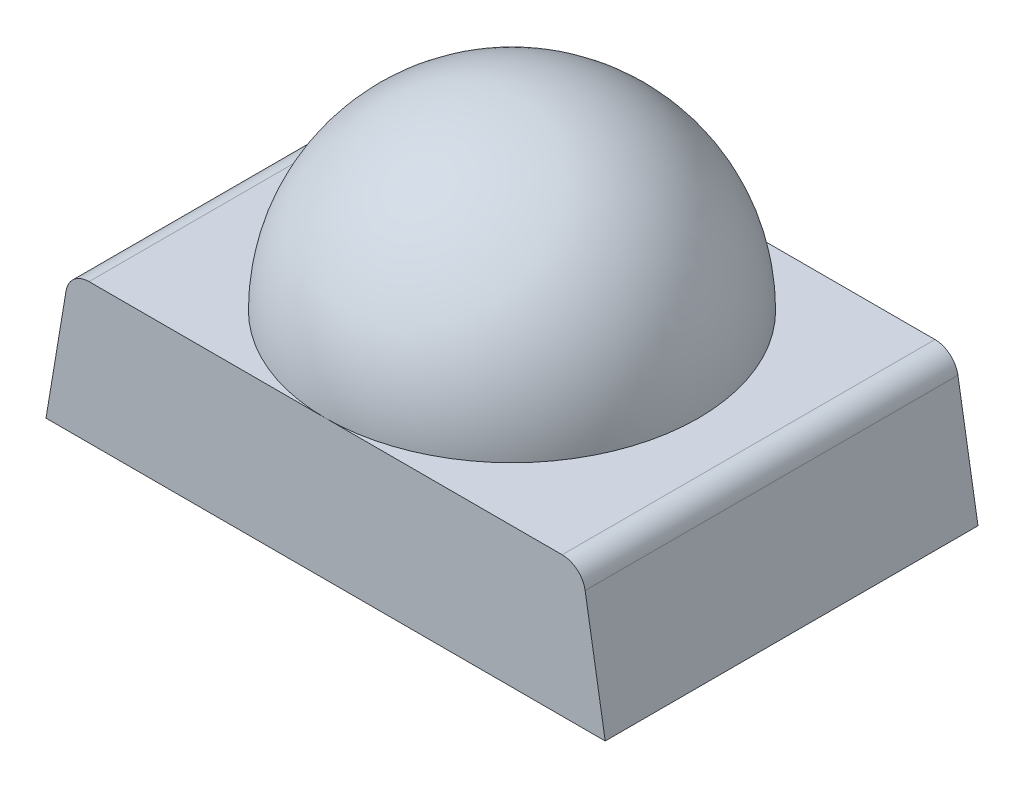
ISO-10303-21;
HEADER;
FILE_DESCRIPTION(('STEP AP214'),'2;1');
FILE_NAME('part.step','',(''),(''),'','','');
FILE_SCHEMA(('AUTOMOTIVE_DESIGN { 1 0 10303 214 1 1 1 1 }'));
ENDSEC;
DATA;
#1=APPLICATION_CONTEXT('core data for automotive mechanical design processes');
#2=APPLICATION_PROTOCOL_DEFINITION('international standard','automotive_design',2000,#1);
#3=PRODUCT_CONTEXT('',#1,'mechanical');
#4=PRODUCT('Part','Part','',(#3));
#5=PRODUCT_RELATED_PRODUCT_CATEGORY('part','',(#4));
#6=PRODUCT_DEFINITION_FORMATION('','',#4);
#7=PRODUCT_DEFINITION_CONTEXT('part definition',#1,'design');
#8=PRODUCT_DEFINITION('design','',#6,#7);
#9=PRODUCT_DEFINITION_SHAPE('','',#8);
#10=(LENGTH_UNIT() NAMED_UNIT(*) SI_UNIT(.MILLI.,.METRE.));
#11=(NAMED_UNIT(*) PLANE_ANGLE_UNIT() SI_UNIT($,.RADIAN.));
#12=(NAMED_UNIT(*) SI_UNIT($,.STERADIAN.) SOLID_ANGLE_UNIT());
#13=UNCERTAINTY_MEASURE_WITH_UNIT(LENGTH_MEASURE(1.E-05),#10,'distance_accuracy_value','');
#14=(GEOMETRIC_REPRESENTATION_CONTEXT(3) GLOBAL_UNCERTAINTY_ASSIGNED_CONTEXT((#13)) GLOBAL_UNIT_ASSIGNED_CONTEXT((#10,
#11,#12)) REPRESENTATION_CONTEXT('',''));
#15=CARTESIAN_POINT('',(0.,0.,0.));
#16=DIRECTION('',(0.,0.,1.));
#17=DIRECTION('',(1.,0.,0.));
#18=AXIS2_PLACEMENT_3D('',#15,#16,#17);
#19=CARTESIAN_POINT('',(0.,0.3,0.));
#20=DIRECTION('',(0.,-1.,0.));
#21=DIRECTION('',(0.,0.,-1.));
#22=AXIS2_PLACEMENT_3D('',#19,#20,#21);
#23=PLANE('',#22);
#24=DIRECTION('',(1.,0.,0.));
#25=VECTOR('',#24,1.);
#26=CARTESIAN_POINT('',(-0.6,0.3,0.4));
#27=LINE('',#26,#25);
#28=CARTESIAN_POINT('',(0.,0.3,0.4));
#29=VERTEX_POINT('',#28);
#30=CARTESIAN_POINT('',(0.507643645580848,0.3,0.4));
#31=VERTEX_POINT('',#30);
#32=EDGE_CURVE('E148',#29,#31,#27,.T.);
#33=ORIENTED_EDGE('',*,*,#32,.T.);
#34=DIRECTION('',(0.,0.,1.));
#35=VECTOR('',#34,1.);
#36=CARTESIAN_POINT('',(0.507643645580848,0.3,-0.4));
#37=LINE('',#36,#35);
#38=CARTESIAN_POINT('',(0.507643645580848,0.3,-0.4));
#39=VERTEX_POINT('',#38);
#40=EDGE_CURVE('E132',#31,#39,#37,.F.);
#41=ORIENTED_EDGE('',*,*,#40,.T.);
#42=DIRECTION('',(-1.,0.,0.));
#43=VECTOR('',#42,1.);
#44=CARTESIAN_POINT('',(-0.6,0.3,-0.4));
#45=LINE('',#44,#43);
#46=CARTESIAN_POINT('',(0.,0.3,-0.4));
#47=VERTEX_POINT('',#46);
#48=EDGE_CURVE('E149',#39,#47,#45,.T.);
#49=ORIENTED_EDGE('',*,*,#48,.T.);
#50=CARTESIAN_POINT('',(0.,0.3,0.));
#51=DIRECTION('',(0.,-1.,0.));
#52=DIRECTION('',(0.,0.,-1.));
#53=AXIS2_PLACEMENT_3D('',#50,#51,#52);
#54=CIRCLE('',#53,0.4);
#55=EDGE_CURVE('E106',#47,#29,#54,.T.);
#56=ORIENTED_EDGE('',*,*,#55,.T.);
#57=EDGE_LOOP('',(#33,#41,#49,#56));
#58=FACE_BOUND('',#57,.T.);
#59=ADVANCED_FACE('F34',(#58),#23,.F.);
#60=CARTESIAN_POINT('',(-0.6,0.3,-0.4));
#61=DIRECTION('',(0.,0.,1.));
#62=DIRECTION('',(1.,0.,0.));
#63=AXIS2_PLACEMENT_3D('',#60,#61,#62);
#64=PLANE('',#63);
#65=ORIENTED_EDGE('',*,*,#48,.F.);
#66=CARTESIAN_POINT('',(0.507643645580848,0.25,-0.4));
#67=DIRECTION('',(0.,0.,1.));
#68=DIRECTION('',(1.,0.,0.));
#69=AXIS2_PLACEMENT_3D('',#66,#67,#68);
#70=CIRCLE('',#69,0.05);
#71=CARTESIAN_POINT('',(0.556963341772455,0.258219949365268,-0.4));
#72=VERTEX_POINT('',#71);
#73=EDGE_CURVE('E113',#39,#72,#70,.F.);
#74=ORIENTED_EDGE('',*,*,#73,.T.);
#75=DIRECTION('',(-0.164398987305357,0.986393923832144,0.));
#76=VECTOR('',#75,1.);
#77=CARTESIAN_POINT('',(0.6,0.,-0.4));
#78=LINE('',#77,#76);
#79=CARTESIAN_POINT('',(0.6,0.,-0.4));
#80=VERTEX_POINT('',#79);
#81=EDGE_CURVE('E97',#80,#72,#78,.T.);
#82=ORIENTED_EDGE('',*,*,#81,.F.);
#83=DIRECTION('',(-1.,0.,0.));
#84=VECTOR('',#83,1.);
#85=CARTESIAN_POINT('',(-0.6,0.,-0.4));
#86=LINE('',#85,#84);
#87=CARTESIAN_POINT('',(-0.6,0.,-0.4));
#88=VERTEX_POINT('',#87);
#89=EDGE_CURVE('E105',#80,#88,#86,.T.);
#90=ORIENTED_EDGE('',*,*,#89,.T.);
#91=DIRECTION('',(0.164398987305357,0.986393923832144,0.));
#92=VECTOR('',#91,1.);
#93=CARTESIAN_POINT('',(-0.6,0.,-0.4));
#94=LINE('',#93,#92);
#95=CARTESIAN_POINT('',(-0.556963341772455,0.258219949365268,-0.4));
#96=VERTEX_POINT('',#95);
#97=EDGE_CURVE('E156',#88,#96,#94,.T.);
#98=ORIENTED_EDGE('',*,*,#97,.T.);
#99=CARTESIAN_POINT('',(-0.507643645580848,0.25,-0.4));
#100=DIRECTION('',(0.,0.,1.));
#101=DIRECTION('',(1.,0.,0.));
#102=AXIS2_PLACEMENT_3D('',#99,#100,#101);
#103=CIRCLE('',#102,0.05);
#104=CARTESIAN_POINT('',(-0.507643645580848,0.3,-0.4));
#105=VERTEX_POINT('',#104);
#106=EDGE_CURVE('E49',#96,#105,#103,.F.);
#107=ORIENTED_EDGE('',*,*,#106,.T.);
#108=EDGE_CURVE('E124',#47,#105,#45,.T.);
#109=ORIENTED_EDGE('',*,*,#108,.F.);
#110=EDGE_LOOP('',(#65,#74,#82,#90,#98,#107,#109));
#111=FACE_BOUND('',#110,.T.);
#112=ADVANCED_FACE('F110',(#111),#64,.F.);
#113=CARTESIAN_POINT('',(-0.6,0.3,0.4));
#114=DIRECTION('',(0.,0.,-1.));
#115=DIRECTION('',(-1.,0.,0.));
#116=AXIS2_PLACEMENT_3D('',#113,#114,#115);
#117=PLANE('',#116);
#118=DIRECTION('',(-0.164398987305357,0.986393923832144,0.));
#119=VECTOR('',#118,1.);
#120=CARTESIAN_POINT('',(0.6,0.,0.4));
#121=LINE('',#120,#119);
#122=CARTESIAN_POINT('',(0.6,0.,0.4));
#123=VERTEX_POINT('',#122);
#124=CARTESIAN_POINT('',(0.556963341772455,0.258219949365268,0.4));
#125=VERTEX_POINT('',#124);
#126=EDGE_CURVE('E100',#123,#125,#121,.T.);
#127=ORIENTED_EDGE('',*,*,#126,.T.);
#128=CARTESIAN_POINT('',(0.507643645580848,0.25,0.4));
#129=DIRECTION('',(0.,0.,-1.));
#130=DIRECTION('',(-1.,0.,0.));
#131=AXIS2_PLACEMENT_3D('',#128,#129,#130);
#132=CIRCLE('',#131,0.05);
#133=EDGE_CURVE('E130',#125,#31,#132,.F.);
#134=ORIENTED_EDGE('',*,*,#133,.T.);
#135=ORIENTED_EDGE('',*,*,#32,.F.);
#136=CARTESIAN_POINT('',(-0.507643645580848,0.3,0.4));
#137=VERTEX_POINT('',#136);
#138=EDGE_CURVE('E128',#137,#29,#27,.T.);
#139=ORIENTED_EDGE('',*,*,#138,.F.);
#140=CARTESIAN_POINT('',(-0.507643645580848,0.25,0.4));
#141=DIRECTION('',(0.,0.,-1.));
#142=DIRECTION('',(-1.,0.,0.));
#143=AXIS2_PLACEMENT_3D('',#140,#141,#142);
#144=CIRCLE('',#143,0.05);
#145=CARTESIAN_POINT('',(-0.556963341772455,0.258219949365268,0.4));
#146=VERTEX_POINT('',#145);
#147=EDGE_CURVE('E127',#137,#146,#144,.F.);
#148=ORIENTED_EDGE('',*,*,#147,.T.);
#149=DIRECTION('',(0.164398987305357,0.986393923832144,0.));
#150=VECTOR('',#149,1.);
#151=CARTESIAN_POINT('',(-0.6,0.,0.4));
#152=LINE('',#151,#150);
#153=CARTESIAN_POINT('',(-0.6,0.,0.4));
#154=VERTEX_POINT('',#153);
#155=EDGE_CURVE('E114',#154,#146,#152,.T.);
#156=ORIENTED_EDGE('',*,*,#155,.F.);
#157=DIRECTION('',(1.,0.,0.));
#158=VECTOR('',#157,1.);
#159=CARTESIAN_POINT('',(-0.6,0.,0.4));
#160=LINE('',#159,#158);
#161=EDGE_CURVE('E119',#154,#123,#160,.T.);
#162=ORIENTED_EDGE('',*,*,#161,.T.);
#163=EDGE_LOOP('',(#127,#134,#135,#139,#148,#156,#162));
#164=FACE_BOUND('',#163,.T.);
#165=ADVANCED_FACE('F145',(#164),#117,.F.);
#166=ORIENTED_EDGE('',*,*,#108,.T.);
#167=DIRECTION('',(0.,0.,1.));
#168=VECTOR('',#167,1.);
#169=CARTESIAN_POINT('',(-0.507643645580848,0.3,0.));
#170=LINE('',#169,#168);
#171=EDGE_CURVE('E42',#105,#137,#170,.T.);
#172=ORIENTED_EDGE('',*,*,#171,.T.);
#173=ORIENTED_EDGE('',*,*,#138,.T.);
#174=EDGE_CURVE('E154',#29,#47,#54,.T.);
#175=ORIENTED_EDGE('',*,*,#174,.T.);
#176=EDGE_LOOP('',(#166,#172,#173,#175));
#177=FACE_BOUND('',#176,.T.);
#178=ADVANCED_FACE('F139',(#177),#23,.F.);
#179=CARTESIAN_POINT('',(0.,0.,0.));
#180=DIRECTION('',(0.,-1.,0.));
#181=DIRECTION('',(0.,0.,-1.));
#182=AXIS2_PLACEMENT_3D('',#179,#180,#181);
#183=PLANE('',#182);
#184=DIRECTION('',(0.,0.,1.));
#185=VECTOR('',#184,1.);
#186=CARTESIAN_POINT('',(-0.6,0.,0.4));
#187=LINE('',#186,#185);
#188=EDGE_CURVE('E117',#88,#154,#187,.T.);
#189=ORIENTED_EDGE('',*,*,#188,.F.);
#190=ORIENTED_EDGE('',*,*,#89,.F.);
#191=DIRECTION('',(0.,0.,-1.));
#192=VECTOR('',#191,1.);
#193=CARTESIAN_POINT('',(0.6,0.,0.4));
#194=LINE('',#193,#192);
#195=EDGE_CURVE('E93',#123,#80,#194,.T.);
#196=ORIENTED_EDGE('',*,*,#195,.F.);
#197=ORIENTED_EDGE('',*,*,#161,.F.);
#198=EDGE_LOOP('',(#189,#190,#196,#197));
#199=FACE_BOUND('',#198,.T.);
#200=ADVANCED_FACE('F116',(#199),#183,.T.);
#201=CARTESIAN_POINT('',(0.,0.3,0.));
#202=DIRECTION('',(0.,-1.,0.));
#203=DIRECTION('',(0.,0.,-1.));
#204=AXIS2_PLACEMENT_3D('',#201,#202,#203);
#205=SPHERICAL_SURFACE('',#204,0.4);
#206=ORIENTED_EDGE('',*,*,#55,.F.);
#207=ORIENTED_EDGE('',*,*,#174,.F.);
#208=EDGE_LOOP('',(#206,#207));
#209=FACE_BOUND('',#208,.T.);
#210=ADVANCED_FACE('F179',(#209),#205,.T.);
#211=CARTESIAN_POINT('',(-0.6,0.,-0.4));
#212=DIRECTION('',(0.986393923832144,-0.164398987305357,0.));
#213=DIRECTION('',(0.164398987305357,0.986393923832144,0.));
#214=AXIS2_PLACEMENT_3D('',#211,#212,#213);
#215=PLANE('',#214);
#216=ORIENTED_EDGE('',*,*,#155,.T.);
#217=DIRECTION('',(0.,0.,1.));
#218=VECTOR('',#217,1.);
#219=CARTESIAN_POINT('',(-0.556963341772455,0.258219949365268,-0.4));
#220=LINE('',#219,#218);
#221=EDGE_CURVE('E11',#146,#96,#220,.F.);
#222=ORIENTED_EDGE('',*,*,#221,.T.);
#223=ORIENTED_EDGE('',*,*,#97,.F.);
#224=ORIENTED_EDGE('',*,*,#188,.T.);
#225=EDGE_LOOP('',(#216,#222,#223,#224));
#226=FACE_BOUND('',#225,.T.);
#227=ADVANCED_FACE('F158',(#226),#215,.F.);
#228=CARTESIAN_POINT('',(0.6,0.,-0.4));
#229=DIRECTION('',(0.986393923832144,0.164398987305357,0.));
#230=DIRECTION('',(-0.164398987305357,0.986393923832144,0.));
#231=AXIS2_PLACEMENT_3D('',#228,#229,#230);
#232=PLANE('',#231);
#233=ORIENTED_EDGE('',*,*,#81,.T.);
#234=DIRECTION('',(0.,0.,1.));
#235=VECTOR('',#234,1.);
#236=CARTESIAN_POINT('',(0.556963341772455,0.258219949365268,0.4));
#237=LINE('',#236,#235);
#238=EDGE_CURVE('E125',#72,#125,#237,.T.);
#239=ORIENTED_EDGE('',*,*,#238,.T.);
#240=ORIENTED_EDGE('',*,*,#126,.F.);
#241=ORIENTED_EDGE('',*,*,#195,.T.);
#242=EDGE_LOOP('',(#233,#239,#240,#241));
#243=FACE_BOUND('',#242,.T.);
#244=ADVANCED_FACE('F95',(#243),#232,.T.);
#245=CARTESIAN_POINT('',(0.507643645580848,0.25,-0.4));
#246=DIRECTION('',(0.,0.,-1.));
#247=DIRECTION('',(-1.,0.,0.));
#248=AXIS2_PLACEMENT_3D('',#245,#246,#247);
#249=CYLINDRICAL_SURFACE('',#248,0.05);
#250=ORIENTED_EDGE('',*,*,#73,.F.);
#251=ORIENTED_EDGE('',*,*,#40,.F.);
#252=ORIENTED_EDGE('',*,*,#133,.F.);
#253=ORIENTED_EDGE('',*,*,#238,.F.);
#254=EDGE_LOOP('',(#250,#251,#252,#253));
#255=FACE_BOUND('',#254,.T.);
#256=ADVANCED_FACE('F160',(#255),#249,.T.);
#257=CARTESIAN_POINT('',(-0.507643645580848,0.25,0.));
#258=DIRECTION('',(0.,0.,1.));
#259=DIRECTION('',(1.,0.,0.));
#260=AXIS2_PLACEMENT_3D('',#257,#258,#259);
#261=CYLINDRICAL_SURFACE('',#260,0.05);
#262=ORIENTED_EDGE('',*,*,#106,.F.);
#263=ORIENTED_EDGE('',*,*,#221,.F.);
#264=ORIENTED_EDGE('',*,*,#147,.F.);
#265=ORIENTED_EDGE('',*,*,#171,.F.);
#266=EDGE_LOOP('',(#262,#263,#264,#265));
#267=FACE_BOUND('',#266,.T.);
#268=ADVANCED_FACE('F36',(#267),#261,.T.);
#269=CLOSED_SHELL('',(#59,#112,#165,#178,#200,#210,#227,#244,#256,#268));
#270=MANIFOLD_SOLID_BREP('B2',#269);
#271=ADVANCED_BREP_SHAPE_REPRESENTATION('',(#18,#270),#14);
#272=SHAPE_DEFINITION_REPRESENTATION(#9,#271);
ENDSEC;
END-ISO-10303-21;
